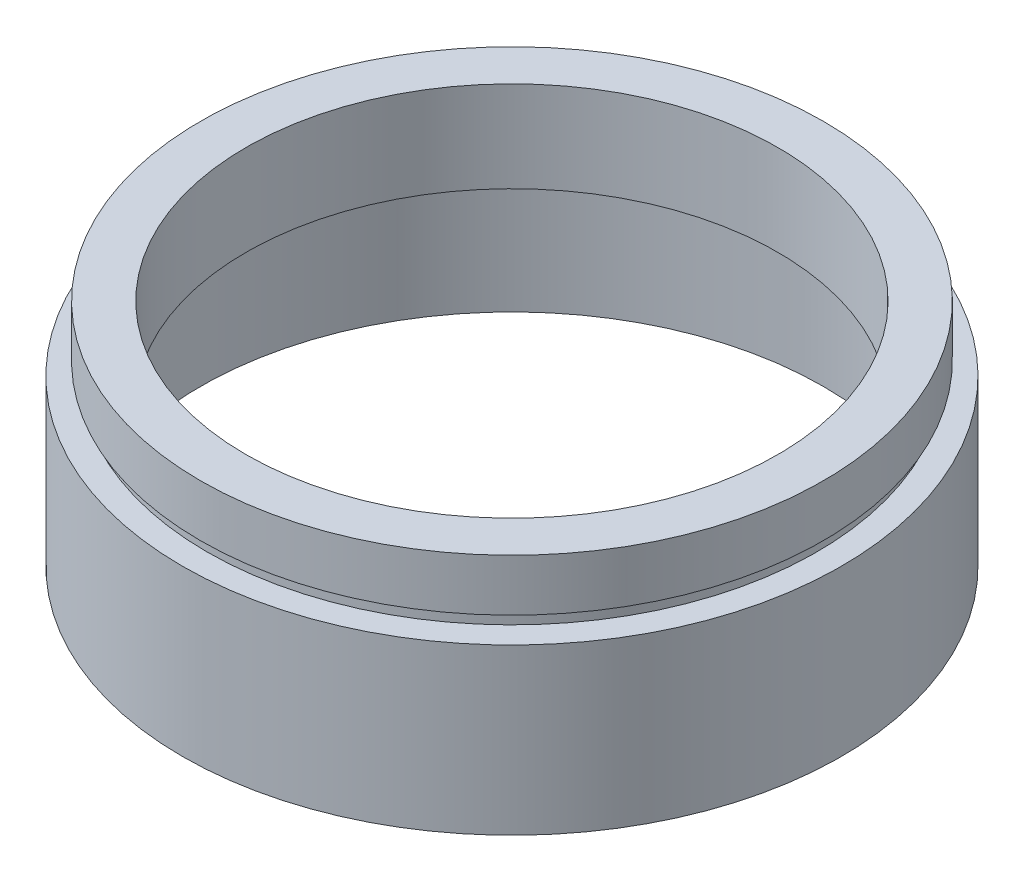
ISO-10303-21;
HEADER;
FILE_DESCRIPTION(('STEP AP214'),'2;1');
FILE_NAME('part.step','',(''),(''),'','','');
FILE_SCHEMA(('AUTOMOTIVE_DESIGN { 1 0 10303 214 1 1 1 1 }'));
ENDSEC;
DATA;
#1=APPLICATION_CONTEXT('core data for automotive mechanical design processes');
#2=APPLICATION_PROTOCOL_DEFINITION('international standard','automotive_design',2000,#1);
#3=PRODUCT_CONTEXT('',#1,'mechanical');
#4=PRODUCT('Part','Part','',(#3));
#5=PRODUCT_RELATED_PRODUCT_CATEGORY('part','',(#4));
#6=PRODUCT_DEFINITION_FORMATION('','',#4);
#7=PRODUCT_DEFINITION_CONTEXT('part definition',#1,'design');
#8=PRODUCT_DEFINITION('design','',#6,#7);
#9=PRODUCT_DEFINITION_SHAPE('','',#8);
#10=(LENGTH_UNIT() NAMED_UNIT(*) SI_UNIT(.MILLI.,.METRE.));
#11=(NAMED_UNIT(*) PLANE_ANGLE_UNIT() SI_UNIT($,.RADIAN.));
#12=(NAMED_UNIT(*) SI_UNIT($,.STERADIAN.) SOLID_ANGLE_UNIT());
#13=UNCERTAINTY_MEASURE_WITH_UNIT(LENGTH_MEASURE(1.E-05),#10,'distance_accuracy_value','');
#14=(GEOMETRIC_REPRESENTATION_CONTEXT(3) GLOBAL_UNCERTAINTY_ASSIGNED_CONTEXT((#13)) GLOBAL_UNIT_ASSIGNED_CONTEXT((#10,
#11,#12)) REPRESENTATION_CONTEXT('',''));
#15=CARTESIAN_POINT('',(0.,0.,0.));
#16=DIRECTION('',(0.,0.,1.));
#17=DIRECTION('',(1.,0.,0.));
#18=AXIS2_PLACEMENT_3D('',#15,#16,#17);
#19=CARTESIAN_POINT('',(0.,161.376166943427,0.));
#20=DIRECTION('',(0.,1.,0.));
#21=DIRECTION('',(0.,0.,1.));
#22=AXIS2_PLACEMENT_3D('',#19,#20,#21);
#23=CYLINDRICAL_SURFACE('',#22,20.5);
#24=CARTESIAN_POINT('',(0.,10.7,0.));
#25=DIRECTION('',(0.,1.,0.));
#26=DIRECTION('',(0.,0.,1.));
#27=AXIS2_PLACEMENT_3D('',#24,#25,#26);
#28=CIRCLE('',#27,20.5);
#29=CARTESIAN_POINT('',(0.,10.7,20.5));
#30=VERTEX_POINT('',#29);
#31=EDGE_CURVE('E77',#30,#30,#28,.T.);
#32=ORIENTED_EDGE('',*,*,#31,.F.);
#33=EDGE_LOOP('',(#32));
#34=FACE_BOUND('',#33,.T.);
#35=CARTESIAN_POINT('',(0.,17.7,0.));
#36=DIRECTION('',(0.,1.,0.));
#37=DIRECTION('',(0.,0.,1.));
#38=AXIS2_PLACEMENT_3D('',#35,#36,#37);
#39=CIRCLE('',#38,20.5);
#40=CARTESIAN_POINT('',(0.,17.7,20.5));
#41=VERTEX_POINT('',#40);
#42=EDGE_CURVE('E10',#41,#41,#39,.T.);
#43=ORIENTED_EDGE('',*,*,#42,.T.);
#44=EDGE_LOOP('',(#43));
#45=FACE_BOUND('',#44,.T.);
#46=ADVANCED_FACE('F37',(#34,#45),#23,.F.);
#47=CARTESIAN_POINT('',(20.5,17.7,0.));
#48=DIRECTION('',(0.,-1.,0.));
#49=DIRECTION('',(0.,0.,-1.));
#50=AXIS2_PLACEMENT_3D('',#47,#48,#49);
#51=PLANE('',#50);
#52=ORIENTED_EDGE('',*,*,#42,.F.);
#53=EDGE_LOOP('',(#52));
#54=FACE_BOUND('',#53,.T.);
#55=CARTESIAN_POINT('',(0.,17.7,0.));
#56=DIRECTION('',(0.,1.,0.));
#57=DIRECTION('',(0.,0.,1.));
#58=AXIS2_PLACEMENT_3D('',#55,#56,#57);
#59=CIRCLE('',#58,24.);
#60=CARTESIAN_POINT('',(0.,17.7,24.));
#61=VERTEX_POINT('',#60);
#62=EDGE_CURVE('E43',#61,#61,#59,.T.);
#63=ORIENTED_EDGE('',*,*,#62,.T.);
#64=EDGE_LOOP('',(#63));
#65=FACE_BOUND('',#64,.T.);
#66=ADVANCED_FACE('F84',(#54,#65),#51,.F.);
#67=CARTESIAN_POINT('',(0.,161.376166943427,0.));
#68=DIRECTION('',(0.,1.,0.));
#69=DIRECTION('',(0.,0.,1.));
#70=AXIS2_PLACEMENT_3D('',#67,#68,#69);
#71=CYLINDRICAL_SURFACE('',#70,24.);
#72=ORIENTED_EDGE('',*,*,#62,.F.);
#73=EDGE_LOOP('',(#72));
#74=FACE_BOUND('',#73,.T.);
#75=CARTESIAN_POINT('',(0.,13.7,0.));
#76=DIRECTION('',(0.,1.,0.));
#77=DIRECTION('',(0.,0.,1.));
#78=AXIS2_PLACEMENT_3D('',#75,#76,#77);
#79=CIRCLE('',#78,24.);
#80=CARTESIAN_POINT('',(0.,13.7,24.));
#81=VERTEX_POINT('',#80);
#82=EDGE_CURVE('E47',#81,#81,#79,.T.);
#83=ORIENTED_EDGE('',*,*,#82,.T.);
#84=EDGE_LOOP('',(#83));
#85=FACE_BOUND('',#84,.T.);
#86=ADVANCED_FACE('F88',(#74,#85),#71,.T.);
#87=CARTESIAN_POINT('',(24.,13.7,0.));
#88=DIRECTION('',(0.,1.,0.));
#89=DIRECTION('',(0.,0.,1.));
#90=AXIS2_PLACEMENT_3D('',#87,#88,#89);
#91=PLANE('',#90);
#92=ORIENTED_EDGE('',*,*,#82,.F.);
#93=EDGE_LOOP('',(#92));
#94=FACE_BOUND('',#93,.T.);
#95=CARTESIAN_POINT('',(0.,13.7,0.));
#96=DIRECTION('',(0.,1.,0.));
#97=DIRECTION('',(0.,0.,1.));
#98=AXIS2_PLACEMENT_3D('',#95,#96,#97);
#99=CIRCLE('',#98,23.5);
#100=CARTESIAN_POINT('',(0.,13.7,23.5));
#101=VERTEX_POINT('',#100);
#102=EDGE_CURVE('E51',#101,#101,#99,.T.);
#103=ORIENTED_EDGE('',*,*,#102,.T.);
#104=EDGE_LOOP('',(#103));
#105=FACE_BOUND('',#104,.T.);
#106=ADVANCED_FACE('F93',(#94,#105),#91,.F.);
#107=CARTESIAN_POINT('',(0.,161.376166943427,0.));
#108=DIRECTION('',(0.,1.,0.));
#109=DIRECTION('',(0.,0.,1.));
#110=AXIS2_PLACEMENT_3D('',#107,#108,#109);
#111=CYLINDRICAL_SURFACE('',#110,23.5);
#112=ORIENTED_EDGE('',*,*,#102,.F.);
#113=EDGE_LOOP('',(#112));
#114=FACE_BOUND('',#113,.T.);
#115=CARTESIAN_POINT('',(0.,12.7,0.));
#116=DIRECTION('',(0.,1.,0.));
#117=DIRECTION('',(0.,0.,1.));
#118=AXIS2_PLACEMENT_3D('',#115,#116,#117);
#119=CIRCLE('',#118,23.5);
#120=CARTESIAN_POINT('',(0.,12.7,23.5));
#121=VERTEX_POINT('',#120);
#122=EDGE_CURVE('E56',#121,#121,#119,.T.);
#123=ORIENTED_EDGE('',*,*,#122,.T.);
#124=EDGE_LOOP('',(#123));
#125=FACE_BOUND('',#124,.T.);
#126=ADVANCED_FACE('F99',(#114,#125),#111,.T.);
#127=CARTESIAN_POINT('',(23.5,12.7,0.));
#128=DIRECTION('',(0.,-1.,0.));
#129=DIRECTION('',(0.,0.,-1.));
#130=AXIS2_PLACEMENT_3D('',#127,#128,#129);
#131=PLANE('',#130);
#132=ORIENTED_EDGE('',*,*,#122,.F.);
#133=EDGE_LOOP('',(#132));
#134=FACE_BOUND('',#133,.T.);
#135=CARTESIAN_POINT('',(0.,12.7,0.));
#136=DIRECTION('',(0.,1.,0.));
#137=DIRECTION('',(0.,0.,1.));
#138=AXIS2_PLACEMENT_3D('',#135,#136,#137);
#139=CIRCLE('',#138,25.4);
#140=CARTESIAN_POINT('',(0.,12.7,25.4));
#141=VERTEX_POINT('',#140);
#142=EDGE_CURVE('E59',#141,#141,#139,.T.);
#143=ORIENTED_EDGE('',*,*,#142,.T.);
#144=EDGE_LOOP('',(#143));
#145=FACE_BOUND('',#144,.T.);
#146=ADVANCED_FACE('F103',(#134,#145),#131,.F.);
#147=CARTESIAN_POINT('',(0.,161.376166943427,0.));
#148=DIRECTION('',(0.,1.,0.));
#149=DIRECTION('',(0.,0.,1.));
#150=AXIS2_PLACEMENT_3D('',#147,#148,#149);
#151=CYLINDRICAL_SURFACE('',#150,25.4);
#152=ORIENTED_EDGE('',*,*,#142,.F.);
#153=EDGE_LOOP('',(#152));
#154=FACE_BOUND('',#153,.T.);
#155=CARTESIAN_POINT('',(0.,0.,0.));
#156=DIRECTION('',(0.,1.,0.));
#157=DIRECTION('',(0.,0.,1.));
#158=AXIS2_PLACEMENT_3D('',#155,#156,#157);
#159=CIRCLE('',#158,25.4);
#160=CARTESIAN_POINT('',(0.,0.,25.4));
#161=VERTEX_POINT('',#160);
#162=EDGE_CURVE('E62',#161,#161,#159,.T.);
#163=ORIENTED_EDGE('',*,*,#162,.T.);
#164=EDGE_LOOP('',(#163));
#165=FACE_BOUND('',#164,.T.);
#166=ADVANCED_FACE('F107',(#154,#165),#151,.T.);
#167=CARTESIAN_POINT('',(25.4,0.,0.));
#168=DIRECTION('',(0.,1.,0.));
#169=DIRECTION('',(0.,0.,1.));
#170=AXIS2_PLACEMENT_3D('',#167,#168,#169);
#171=PLANE('',#170);
#172=ORIENTED_EDGE('',*,*,#162,.F.);
#173=EDGE_LOOP('',(#172));
#174=FACE_BOUND('',#173,.T.);
#175=CARTESIAN_POINT('',(0.,0.,0.));
#176=DIRECTION('',(0.,1.,0.));
#177=DIRECTION('',(0.,0.,1.));
#178=AXIS2_PLACEMENT_3D('',#175,#176,#177);
#179=CIRCLE('',#178,24.);
#180=CARTESIAN_POINT('',(0.,0.,24.));
#181=VERTEX_POINT('',#180);
#182=EDGE_CURVE('E65',#181,#181,#179,.T.);
#183=ORIENTED_EDGE('',*,*,#182,.T.);
#184=EDGE_LOOP('',(#183));
#185=FACE_BOUND('',#184,.T.);
#186=ADVANCED_FACE('F111',(#174,#185),#171,.F.);
#187=CARTESIAN_POINT('',(0.,161.376166943427,0.));
#188=DIRECTION('',(0.,1.,0.));
#189=DIRECTION('',(0.,0.,1.));
#190=AXIS2_PLACEMENT_3D('',#187,#188,#189);
#191=CYLINDRICAL_SURFACE('',#190,24.);
#192=ORIENTED_EDGE('',*,*,#182,.F.);
#193=EDGE_LOOP('',(#192));
#194=FACE_BOUND('',#193,.T.);
#195=CARTESIAN_POINT('',(0.,9.69999999999999,0.));
#196=DIRECTION('',(0.,1.,0.));
#197=DIRECTION('',(0.,0.,1.));
#198=AXIS2_PLACEMENT_3D('',#195,#196,#197);
#199=CIRCLE('',#198,24.);
#200=CARTESIAN_POINT('',(0.,9.69999999999999,24.));
#201=VERTEX_POINT('',#200);
#202=EDGE_CURVE('E68',#201,#201,#199,.T.);
#203=ORIENTED_EDGE('',*,*,#202,.T.);
#204=EDGE_LOOP('',(#203));
#205=FACE_BOUND('',#204,.T.);
#206=ADVANCED_FACE('F115',(#194,#205),#191,.F.);
#207=CARTESIAN_POINT('',(24.,9.69999999999999,0.));
#208=DIRECTION('',(0.,-1.,0.));
#209=DIRECTION('',(0.,0.,-1.));
#210=AXIS2_PLACEMENT_3D('',#207,#208,#209);
#211=PLANE('',#210);
#212=ORIENTED_EDGE('',*,*,#202,.F.);
#213=EDGE_LOOP('',(#212));
#214=FACE_BOUND('',#213,.T.);
#215=CARTESIAN_POINT('',(0.,9.69999999999999,0.));
#216=DIRECTION('',(0.,1.,0.));
#217=DIRECTION('',(0.,0.,1.));
#218=AXIS2_PLACEMENT_3D('',#215,#216,#217);
#219=CIRCLE('',#218,24.1);
#220=CARTESIAN_POINT('',(0.,9.69999999999999,24.1));
#221=VERTEX_POINT('',#220);
#222=EDGE_CURVE('E71',#221,#221,#219,.T.);
#223=ORIENTED_EDGE('',*,*,#222,.T.);
#224=EDGE_LOOP('',(#223));
#225=FACE_BOUND('',#224,.T.);
#226=ADVANCED_FACE('F119',(#214,#225),#211,.F.);
#227=CARTESIAN_POINT('',(0.,161.376166943427,0.));
#228=DIRECTION('',(0.,1.,0.));
#229=DIRECTION('',(0.,0.,1.));
#230=AXIS2_PLACEMENT_3D('',#227,#228,#229);
#231=CYLINDRICAL_SURFACE('',#230,24.1);
#232=ORIENTED_EDGE('',*,*,#222,.F.);
#233=EDGE_LOOP('',(#232));
#234=FACE_BOUND('',#233,.T.);
#235=CARTESIAN_POINT('',(0.,10.7,0.));
#236=DIRECTION('',(0.,1.,0.));
#237=DIRECTION('',(0.,0.,1.));
#238=AXIS2_PLACEMENT_3D('',#235,#236,#237);
#239=CIRCLE('',#238,24.1);
#240=CARTESIAN_POINT('',(0.,10.7,24.1));
#241=VERTEX_POINT('',#240);
#242=EDGE_CURVE('E74',#241,#241,#239,.T.);
#243=ORIENTED_EDGE('',*,*,#242,.T.);
#244=EDGE_LOOP('',(#243));
#245=FACE_BOUND('',#244,.T.);
#246=ADVANCED_FACE('F123',(#234,#245),#231,.F.);
#247=CARTESIAN_POINT('',(24.1,10.7,0.));
#248=DIRECTION('',(0.,1.,0.));
#249=DIRECTION('',(0.,0.,1.));
#250=AXIS2_PLACEMENT_3D('',#247,#248,#249);
#251=PLANE('',#250);
#252=ORIENTED_EDGE('',*,*,#242,.F.);
#253=EDGE_LOOP('',(#252));
#254=FACE_BOUND('',#253,.T.);
#255=ORIENTED_EDGE('',*,*,#31,.T.);
#256=EDGE_LOOP('',(#255));
#257=FACE_BOUND('',#256,.T.);
#258=ADVANCED_FACE('F81',(#254,#257),#251,.F.);
#259=CLOSED_SHELL('',(#46,#66,#86,#106,#126,#146,#166,#186,#206,#226,#246,#258));
#260=MANIFOLD_SOLID_BREP('B2',#259);
#261=ADVANCED_BREP_SHAPE_REPRESENTATION('',(#18,#260),#14);
#262=SHAPE_DEFINITION_REPRESENTATION(#9,#261);
ENDSEC;
END-ISO-10303-21;
